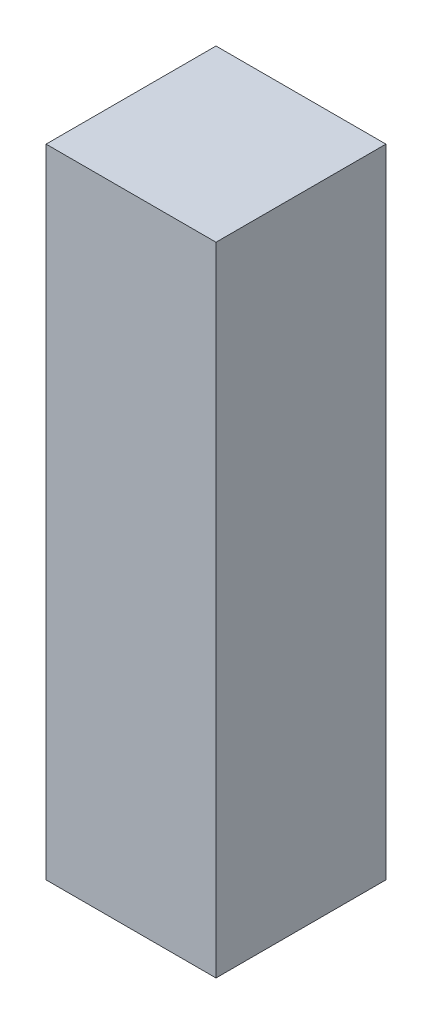
ISO-10303-21;
HEADER;
FILE_DESCRIPTION(('STEP AP214'),'2;1');
FILE_NAME('part.step','',(''),(''),'','','');
FILE_SCHEMA(('AUTOMOTIVE_DESIGN { 1 0 10303 214 1 1 1 1 }'));
ENDSEC;
DATA;
#1=APPLICATION_CONTEXT('core data for automotive mechanical design processes');
#2=APPLICATION_PROTOCOL_DEFINITION('international standard','automotive_design',2000,#1);
#3=PRODUCT_CONTEXT('',#1,'mechanical');
#4=PRODUCT('Part','Part','',(#3));
#5=PRODUCT_RELATED_PRODUCT_CATEGORY('part','',(#4));
#6=PRODUCT_DEFINITION_FORMATION('','',#4);
#7=PRODUCT_DEFINITION_CONTEXT('part definition',#1,'design');
#8=PRODUCT_DEFINITION('design','',#6,#7);
#9=PRODUCT_DEFINITION_SHAPE('','',#8);
#10=(LENGTH_UNIT() NAMED_UNIT(*) SI_UNIT(.MILLI.,.METRE.));
#11=(NAMED_UNIT(*) PLANE_ANGLE_UNIT() SI_UNIT($,.RADIAN.));
#12=(NAMED_UNIT(*) SI_UNIT($,.STERADIAN.) SOLID_ANGLE_UNIT());
#13=UNCERTAINTY_MEASURE_WITH_UNIT(LENGTH_MEASURE(1.E-05),#10,'distance_accuracy_value','');
#14=(GEOMETRIC_REPRESENTATION_CONTEXT(3) GLOBAL_UNCERTAINTY_ASSIGNED_CONTEXT((#13)) GLOBAL_UNIT_ASSIGNED_CONTEXT((#10,
#11,#12)) REPRESENTATION_CONTEXT('',''));
#15=CARTESIAN_POINT('',(0.,0.,0.));
#16=DIRECTION('',(0.,0.,1.));
#17=DIRECTION('',(1.,0.,0.));
#18=AXIS2_PLACEMENT_3D('',#15,#16,#17);
#19=CARTESIAN_POINT('',(-36.5947048289947,-381.,-54.410152284264));
#20=DIRECTION('',(-1.,0.,0.));
#21=DIRECTION('',(0.,0.,1.));
#22=AXIS2_PLACEMENT_3D('',#19,#20,#21);
#23=PLANE('',#22);
#24=DIRECTION('',(0.,0.,1.));
#25=VECTOR('',#24,1.);
#26=CARTESIAN_POINT('',(-36.5947048289947,0.,-54.410152284264));
#27=LINE('',#26,#25);
#28=CARTESIAN_POINT('',(-36.5947048289947,0.,-54.410152284264));
#29=VERTEX_POINT('',#28);
#30=CARTESIAN_POINT('',(-36.5947048289947,0.,47.189847715736));
#31=VERTEX_POINT('',#30);
#32=EDGE_CURVE('E109',#29,#31,#27,.T.);
#33=ORIENTED_EDGE('',*,*,#32,.F.);
#34=DIRECTION('',(0.,1.,0.));
#35=VECTOR('',#34,1.);
#36=CARTESIAN_POINT('',(-36.5947048289947,-381.,-54.410152284264));
#37=LINE('',#36,#35);
#38=CARTESIAN_POINT('',(-36.5947048289947,-381.,-54.410152284264));
#39=VERTEX_POINT('',#38);
#40=EDGE_CURVE('E11',#39,#29,#37,.T.);
#41=ORIENTED_EDGE('',*,*,#40,.F.);
#42=DIRECTION('',(0.,0.,1.));
#43=VECTOR('',#42,1.);
#44=CARTESIAN_POINT('',(-36.5947048289947,-381.,-54.410152284264));
#45=LINE('',#44,#43);
#46=CARTESIAN_POINT('',(-36.5947048289947,-381.,47.189847715736));
#47=VERTEX_POINT('',#46);
#48=EDGE_CURVE('E103',#39,#47,#45,.T.);
#49=ORIENTED_EDGE('',*,*,#48,.T.);
#50=DIRECTION('',(0.,1.,0.));
#51=VECTOR('',#50,1.);
#52=CARTESIAN_POINT('',(-36.5947048289947,-381.,47.189847715736));
#53=LINE('',#52,#51);
#54=EDGE_CURVE('E48',#47,#31,#53,.T.);
#55=ORIENTED_EDGE('',*,*,#54,.T.);
#56=EDGE_LOOP('',(#33,#41,#49,#55));
#57=FACE_BOUND('',#56,.T.);
#58=ADVANCED_FACE('F45',(#57),#23,.T.);
#59=CARTESIAN_POINT('',(-36.5947048289947,-381.,-54.410152284264));
#60=DIRECTION('',(0.,0.,-1.));
#61=DIRECTION('',(-1.,0.,0.));
#62=AXIS2_PLACEMENT_3D('',#59,#60,#61);
#63=PLANE('',#62);
#64=DIRECTION('',(-1.,0.,0.));
#65=VECTOR('',#64,1.);
#66=CARTESIAN_POINT('',(-36.5947048289947,0.,-54.410152284264));
#67=LINE('',#66,#65);
#68=CARTESIAN_POINT('',(65.0052951710053,0.,-54.410152284264));
#69=VERTEX_POINT('',#68);
#70=EDGE_CURVE('E105',#69,#29,#67,.T.);
#71=ORIENTED_EDGE('',*,*,#70,.F.);
#72=DIRECTION('',(0.,1.,0.));
#73=VECTOR('',#72,1.);
#74=CARTESIAN_POINT('',(65.0052951710053,-381.,-54.410152284264));
#75=LINE('',#74,#73);
#76=CARTESIAN_POINT('',(65.0052951710053,-381.,-54.410152284264));
#77=VERTEX_POINT('',#76);
#78=EDGE_CURVE('E54',#77,#69,#75,.T.);
#79=ORIENTED_EDGE('',*,*,#78,.F.);
#80=DIRECTION('',(-1.,0.,0.));
#81=VECTOR('',#80,1.);
#82=CARTESIAN_POINT('',(-36.5947048289947,-381.,-54.410152284264));
#83=LINE('',#82,#81);
#84=EDGE_CURVE('E100',#77,#39,#83,.T.);
#85=ORIENTED_EDGE('',*,*,#84,.T.);
#86=ORIENTED_EDGE('',*,*,#40,.T.);
#87=EDGE_LOOP('',(#71,#79,#85,#86));
#88=FACE_BOUND('',#87,.T.);
#89=ADVANCED_FACE('F119',(#88),#63,.T.);
#90=CARTESIAN_POINT('',(65.0052951710053,-381.,-54.410152284264));
#91=DIRECTION('',(1.,0.,0.));
#92=DIRECTION('',(0.,0.,-1.));
#93=AXIS2_PLACEMENT_3D('',#90,#91,#92);
#94=PLANE('',#93);
#95=DIRECTION('',(0.,0.,-1.));
#96=VECTOR('',#95,1.);
#97=CARTESIAN_POINT('',(65.0052951710053,0.,-54.410152284264));
#98=LINE('',#97,#96);
#99=CARTESIAN_POINT('',(65.0052951710053,0.,47.189847715736));
#100=VERTEX_POINT('',#99);
#101=EDGE_CURVE('E95',#100,#69,#98,.T.);
#102=ORIENTED_EDGE('',*,*,#101,.F.);
#103=DIRECTION('',(0.,1.,0.));
#104=VECTOR('',#103,1.);
#105=CARTESIAN_POINT('',(65.0052951710053,-381.,47.189847715736));
#106=LINE('',#105,#104);
#107=CARTESIAN_POINT('',(65.0052951710053,-381.,47.189847715736));
#108=VERTEX_POINT('',#107);
#109=EDGE_CURVE('E90',#108,#100,#106,.T.);
#110=ORIENTED_EDGE('',*,*,#109,.F.);
#111=DIRECTION('',(0.,0.,-1.));
#112=VECTOR('',#111,1.);
#113=CARTESIAN_POINT('',(65.0052951710053,-381.,-54.410152284264));
#114=LINE('',#113,#112);
#115=EDGE_CURVE('E93',#108,#77,#114,.T.);
#116=ORIENTED_EDGE('',*,*,#115,.T.);
#117=ORIENTED_EDGE('',*,*,#78,.T.);
#118=EDGE_LOOP('',(#102,#110,#116,#117));
#119=FACE_BOUND('',#118,.T.);
#120=ADVANCED_FACE('F92',(#119),#94,.T.);
#121=CARTESIAN_POINT('',(-36.5947048289947,-381.,47.189847715736));
#122=DIRECTION('',(0.,0.,1.));
#123=DIRECTION('',(1.,0.,0.));
#124=AXIS2_PLACEMENT_3D('',#121,#122,#123);
#125=PLANE('',#124);
#126=DIRECTION('',(1.,0.,0.));
#127=VECTOR('',#126,1.);
#128=CARTESIAN_POINT('',(-36.5947048289947,0.,47.189847715736));
#129=LINE('',#128,#127);
#130=EDGE_CURVE('E112',#31,#100,#129,.T.);
#131=ORIENTED_EDGE('',*,*,#130,.F.);
#132=ORIENTED_EDGE('',*,*,#54,.F.);
#133=DIRECTION('',(1.,0.,0.));
#134=VECTOR('',#133,1.);
#135=CARTESIAN_POINT('',(-36.5947048289947,-381.,47.189847715736));
#136=LINE('',#135,#134);
#137=EDGE_CURVE('E99',#47,#108,#136,.T.);
#138=ORIENTED_EDGE('',*,*,#137,.T.);
#139=ORIENTED_EDGE('',*,*,#109,.T.);
#140=EDGE_LOOP('',(#131,#132,#138,#139));
#141=FACE_BOUND('',#140,.T.);
#142=ADVANCED_FACE('F102',(#141),#125,.T.);
#143=CARTESIAN_POINT('',(0.,-381.,0.));
#144=DIRECTION('',(0.,1.,0.));
#145=DIRECTION('',(0.,0.,1.));
#146=AXIS2_PLACEMENT_3D('',#143,#144,#145);
#147=PLANE('',#146);
#148=ORIENTED_EDGE('',*,*,#48,.F.);
#149=ORIENTED_EDGE('',*,*,#84,.F.);
#150=ORIENTED_EDGE('',*,*,#115,.F.);
#151=ORIENTED_EDGE('',*,*,#137,.F.);
#152=EDGE_LOOP('',(#148,#149,#150,#151));
#153=FACE_BOUND('',#152,.T.);
#154=ADVANCED_FACE('F98',(#153),#147,.F.);
#155=CARTESIAN_POINT('',(0.,0.,0.));
#156=DIRECTION('',(0.,1.,0.));
#157=DIRECTION('',(0.,0.,1.));
#158=AXIS2_PLACEMENT_3D('',#155,#156,#157);
#159=PLANE('',#158);
#160=ORIENTED_EDGE('',*,*,#32,.T.);
#161=ORIENTED_EDGE('',*,*,#130,.T.);
#162=ORIENTED_EDGE('',*,*,#101,.T.);
#163=ORIENTED_EDGE('',*,*,#70,.T.);
#164=EDGE_LOOP('',(#160,#161,#162,#163));
#165=FACE_BOUND('',#164,.T.);
#166=ADVANCED_FACE('F118',(#165),#159,.T.);
#167=CLOSED_SHELL('',(#58,#89,#120,#142,#154,#166));
#168=MANIFOLD_SOLID_BREP('B2',#167);
#169=ADVANCED_BREP_SHAPE_REPRESENTATION('',(#18,#168),#14);
#170=SHAPE_DEFINITION_REPRESENTATION(#9,#169);
ENDSEC;
END-ISO-10303-21;
